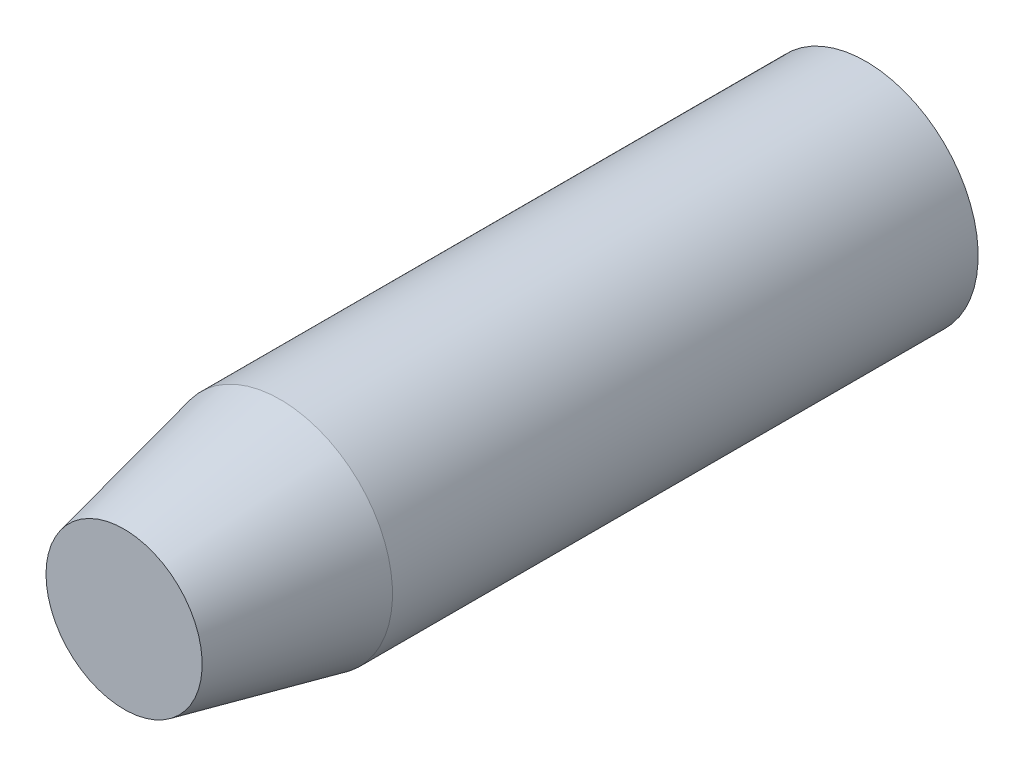
ISO-10303-21;
HEADER;
FILE_DESCRIPTION(('STEP AP214'),'2;1');
FILE_NAME('part.step','',(''),(''),'','','');
FILE_SCHEMA(('AUTOMOTIVE_DESIGN { 1 0 10303 214 1 1 1 1 }'));
ENDSEC;
DATA;
#1=APPLICATION_CONTEXT('core data for automotive mechanical design processes');
#2=APPLICATION_PROTOCOL_DEFINITION('international standard','automotive_design',2000,#1);
#3=PRODUCT_CONTEXT('',#1,'mechanical');
#4=PRODUCT('Part','Part','',(#3));
#5=PRODUCT_RELATED_PRODUCT_CATEGORY('part','',(#4));
#6=PRODUCT_DEFINITION_FORMATION('','',#4);
#7=PRODUCT_DEFINITION_CONTEXT('part definition',#1,'design');
#8=PRODUCT_DEFINITION('design','',#6,#7);
#9=PRODUCT_DEFINITION_SHAPE('','',#8);
#10=(LENGTH_UNIT() NAMED_UNIT(*) SI_UNIT(.MILLI.,.METRE.));
#11=(NAMED_UNIT(*) PLANE_ANGLE_UNIT() SI_UNIT($,.RADIAN.));
#12=(NAMED_UNIT(*) SI_UNIT($,.STERADIAN.) SOLID_ANGLE_UNIT());
#13=UNCERTAINTY_MEASURE_WITH_UNIT(LENGTH_MEASURE(1.E-05),#10,'distance_accuracy_value','');
#14=(GEOMETRIC_REPRESENTATION_CONTEXT(3) GLOBAL_UNCERTAINTY_ASSIGNED_CONTEXT((#13)) GLOBAL_UNIT_ASSIGNED_CONTEXT((#10,
#11,#12)) REPRESENTATION_CONTEXT('',''));
#15=CARTESIAN_POINT('',(0.,0.,0.));
#16=DIRECTION('',(0.,0.,1.));
#17=DIRECTION('',(1.,0.,0.));
#18=AXIS2_PLACEMENT_3D('',#15,#16,#17);
#19=CARTESIAN_POINT('',(0.,0.,0.));
#20=DIRECTION('',(0.,0.,-1.));
#21=DIRECTION('',(-1.,0.,0.));
#22=AXIS2_PLACEMENT_3D('',#19,#20,#21);
#23=PLANE('',#22);
#24=CARTESIAN_POINT('',(0.,0.,0.));
#25=DIRECTION('',(0.,0.,-1.));
#26=DIRECTION('',(-1.,0.,0.));
#27=AXIS2_PLACEMENT_3D('',#24,#25,#26);
#28=CIRCLE('',#27,12.6999999999997);
#29=CARTESIAN_POINT('',(-12.6999999999997,0.,0.));
#30=VERTEX_POINT('',#29);
#31=EDGE_CURVE('E18',#30,#30,#28,.T.);
#32=ORIENTED_EDGE('',*,*,#31,.F.);
#33=EDGE_LOOP('',(#32));
#34=FACE_BOUND('',#33,.T.);
#35=ADVANCED_FACE('F15',(#34),#23,.F.);
#36=CARTESIAN_POINT('',(0.,0.,-120.65));
#37=DIRECTION('',(0.,0.,-1.));
#38=DIRECTION('',(-1.,0.,0.));
#39=AXIS2_PLACEMENT_3D('',#36,#37,#38);
#40=PLANE('',#39);
#41=CARTESIAN_POINT('',(0.,0.,-120.65));
#42=DIRECTION('',(0.,0.,-1.));
#43=DIRECTION('',(-1.,0.,0.));
#44=AXIS2_PLACEMENT_3D('',#41,#42,#43);
#45=CIRCLE('',#44,18.25625);
#46=CARTESIAN_POINT('',(-18.25625,0.,-120.65));
#47=VERTEX_POINT('',#46);
#48=EDGE_CURVE('E22',#47,#47,#45,.F.);
#49=ORIENTED_EDGE('',*,*,#48,.F.);
#50=EDGE_LOOP('',(#49));
#51=FACE_BOUND('',#50,.T.);
#52=ADVANCED_FACE('F36',(#51),#40,.T.);
#53=CARTESIAN_POINT('',(0.,0.,-25.3999999999999));
#54=DIRECTION('',(0.,0.,-1.));
#55=DIRECTION('',(-1.,0.,0.));
#56=AXIS2_PLACEMENT_3D('',#53,#54,#55);
#57=CONICAL_SURFACE('',#56,18.2562500000003,0.215357699697764);
#58=ORIENTED_EDGE('',*,*,#31,.T.);
#59=EDGE_LOOP('',(#58));
#60=FACE_BOUND('',#59,.T.);
#61=CARTESIAN_POINT('',(0.,0.,-25.4));
#62=DIRECTION('',(0.,0.,-1.));
#63=DIRECTION('',(-1.,0.,0.));
#64=AXIS2_PLACEMENT_3D('',#61,#62,#63);
#65=CIRCLE('',#64,18.25625);
#66=CARTESIAN_POINT('',(-18.25625,0.,-25.4));
#67=VERTEX_POINT('',#66);
#68=EDGE_CURVE('E10',#67,#67,#65,.T.);
#69=ORIENTED_EDGE('',*,*,#68,.F.);
#70=EDGE_LOOP('',(#69));
#71=FACE_BOUND('',#70,.T.);
#72=ADVANCED_FACE('F32',(#60,#71),#57,.T.);
#73=CARTESIAN_POINT('',(0.,0.,0.));
#74=DIRECTION('',(0.,0.,-1.));
#75=DIRECTION('',(-1.,0.,0.));
#76=AXIS2_PLACEMENT_3D('',#73,#74,#75);
#77=CYLINDRICAL_SURFACE('',#76,18.25625);
#78=ORIENTED_EDGE('',*,*,#68,.T.);
#79=EDGE_LOOP('',(#78));
#80=FACE_BOUND('',#79,.T.);
#81=ORIENTED_EDGE('',*,*,#48,.T.);
#82=EDGE_LOOP('',(#81));
#83=FACE_BOUND('',#82,.T.);
#84=ADVANCED_FACE('F42',(#80,#83),#77,.T.);
#85=CLOSED_SHELL('',(#35,#52,#72,#84));
#86=MANIFOLD_SOLID_BREP('B1',#85);
#87=ADVANCED_BREP_SHAPE_REPRESENTATION('',(#18,#86),#14);
#88=SHAPE_DEFINITION_REPRESENTATION(#9,#87);
ENDSEC;
END-ISO-10303-21;
